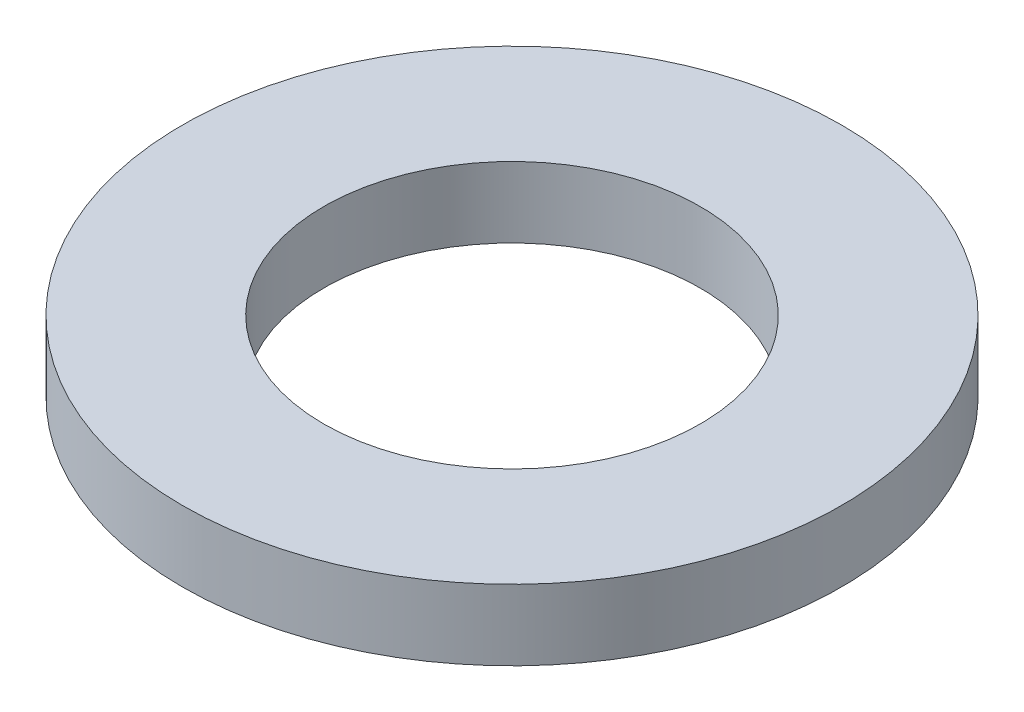
ISO-10303-21;
HEADER;
FILE_DESCRIPTION(('STEP AP214'),'2;1');
FILE_NAME('part.step','',(''),(''),'','','');
FILE_SCHEMA(('AUTOMOTIVE_DESIGN { 1 0 10303 214 1 1 1 1 }'));
ENDSEC;
DATA;
#1=APPLICATION_CONTEXT('core data for automotive mechanical design processes');
#2=APPLICATION_PROTOCOL_DEFINITION('international standard','automotive_design',2000,#1);
#3=PRODUCT_CONTEXT('',#1,'mechanical');
#4=PRODUCT('Part','Part','',(#3));
#5=PRODUCT_RELATED_PRODUCT_CATEGORY('part','',(#4));
#6=PRODUCT_DEFINITION_FORMATION('','',#4);
#7=PRODUCT_DEFINITION_CONTEXT('part definition',#1,'design');
#8=PRODUCT_DEFINITION('design','',#6,#7);
#9=PRODUCT_DEFINITION_SHAPE('','',#8);
#10=(LENGTH_UNIT() NAMED_UNIT(*) SI_UNIT(.MILLI.,.METRE.));
#11=(NAMED_UNIT(*) PLANE_ANGLE_UNIT() SI_UNIT($,.RADIAN.));
#12=(NAMED_UNIT(*) SI_UNIT($,.STERADIAN.) SOLID_ANGLE_UNIT());
#13=UNCERTAINTY_MEASURE_WITH_UNIT(LENGTH_MEASURE(1.E-05),#10,'distance_accuracy_value','');
#14=(GEOMETRIC_REPRESENTATION_CONTEXT(3) GLOBAL_UNCERTAINTY_ASSIGNED_CONTEXT((#13)) GLOBAL_UNIT_ASSIGNED_CONTEXT((#10,
#11,#12)) REPRESENTATION_CONTEXT('',''));
#15=CARTESIAN_POINT('',(0.,0.,0.));
#16=DIRECTION('',(0.,0.,1.));
#17=DIRECTION('',(1.,0.,0.));
#18=AXIS2_PLACEMENT_3D('',#15,#16,#17);
#19=CARTESIAN_POINT('',(0.,3.,0.));
#20=DIRECTION('',(0.,1.,0.));
#21=DIRECTION('',(0.,0.,1.));
#22=AXIS2_PLACEMENT_3D('',#19,#20,#21);
#23=PLANE('',#22);
#24=CARTESIAN_POINT('',(0.,3.,0.));
#25=DIRECTION('',(0.,1.,0.));
#26=DIRECTION('',(0.,0.,1.));
#27=AXIS2_PLACEMENT_3D('',#24,#25,#26);
#28=CIRCLE('',#27,14.);
#29=CARTESIAN_POINT('',(0.,3.,14.));
#30=VERTEX_POINT('',#29);
#31=EDGE_CURVE('E10',#30,#30,#28,.T.);
#32=ORIENTED_EDGE('',*,*,#31,.T.);
#33=EDGE_LOOP('',(#32));
#34=FACE_BOUND('',#33,.T.);
#35=CARTESIAN_POINT('',(0.,3.,0.));
#36=DIRECTION('',(0.,1.,0.));
#37=DIRECTION('',(0.,0.,1.));
#38=AXIS2_PLACEMENT_3D('',#35,#36,#37);
#39=CIRCLE('',#38,8.);
#40=CARTESIAN_POINT('',(0.,3.,8.));
#41=VERTEX_POINT('',#40);
#42=EDGE_CURVE('E46',#41,#41,#39,.T.);
#43=ORIENTED_EDGE('',*,*,#42,.F.);
#44=EDGE_LOOP('',(#43));
#45=FACE_BOUND('',#44,.T.);
#46=ADVANCED_FACE('F35',(#34,#45),#23,.T.);
#47=CARTESIAN_POINT('',(0.,0.,0.));
#48=DIRECTION('',(0.,1.,0.));
#49=DIRECTION('',(0.,0.,1.));
#50=AXIS2_PLACEMENT_3D('',#47,#48,#49);
#51=PLANE('',#50);
#52=CARTESIAN_POINT('',(0.,0.,0.));
#53=DIRECTION('',(0.,1.,0.));
#54=DIRECTION('',(0.,0.,1.));
#55=AXIS2_PLACEMENT_3D('',#52,#53,#54);
#56=CIRCLE('',#55,14.);
#57=CARTESIAN_POINT('',(0.,0.,14.));
#58=VERTEX_POINT('',#57);
#59=EDGE_CURVE('E39',#58,#58,#56,.T.);
#60=ORIENTED_EDGE('',*,*,#59,.F.);
#61=EDGE_LOOP('',(#60));
#62=FACE_BOUND('',#61,.T.);
#63=CARTESIAN_POINT('',(0.,0.,0.));
#64=DIRECTION('',(0.,1.,0.));
#65=DIRECTION('',(0.,0.,1.));
#66=AXIS2_PLACEMENT_3D('',#63,#64,#65);
#67=CIRCLE('',#66,8.);
#68=CARTESIAN_POINT('',(0.,0.,8.));
#69=VERTEX_POINT('',#68);
#70=EDGE_CURVE('E48',#69,#69,#67,.T.);
#71=ORIENTED_EDGE('',*,*,#70,.T.);
#72=EDGE_LOOP('',(#71));
#73=FACE_BOUND('',#72,.T.);
#74=ADVANCED_FACE('F58',(#62,#73),#51,.F.);
#75=CARTESIAN_POINT('',(0.,3.,0.));
#76=DIRECTION('',(0.,-1.,0.));
#77=DIRECTION('',(0.,0.,-1.));
#78=AXIS2_PLACEMENT_3D('',#75,#76,#77);
#79=CYLINDRICAL_SURFACE('',#78,14.);
#80=ORIENTED_EDGE('',*,*,#31,.F.);
#81=EDGE_LOOP('',(#80));
#82=FACE_BOUND('',#81,.T.);
#83=ORIENTED_EDGE('',*,*,#59,.T.);
#84=EDGE_LOOP('',(#83));
#85=FACE_BOUND('',#84,.T.);
#86=ADVANCED_FACE('F37',(#82,#85),#79,.T.);
#87=CARTESIAN_POINT('',(0.,3.,0.));
#88=DIRECTION('',(0.,-1.,0.));
#89=DIRECTION('',(0.,0.,-1.));
#90=AXIS2_PLACEMENT_3D('',#87,#88,#89);
#91=CYLINDRICAL_SURFACE('',#90,8.);
#92=ORIENTED_EDGE('',*,*,#42,.T.);
#93=EDGE_LOOP('',(#92));
#94=FACE_BOUND('',#93,.T.);
#95=ORIENTED_EDGE('',*,*,#70,.F.);
#96=EDGE_LOOP('',(#95));
#97=FACE_BOUND('',#96,.T.);
#98=ADVANCED_FACE('F54',(#94,#97),#91,.F.);
#99=CLOSED_SHELL('',(#46,#74,#86,#98));
#100=MANIFOLD_SOLID_BREP('B2',#99);
#101=ADVANCED_BREP_SHAPE_REPRESENTATION('',(#18,#100),#14);
#102=SHAPE_DEFINITION_REPRESENTATION(#9,#101);
ENDSEC;
END-ISO-10303-21;
